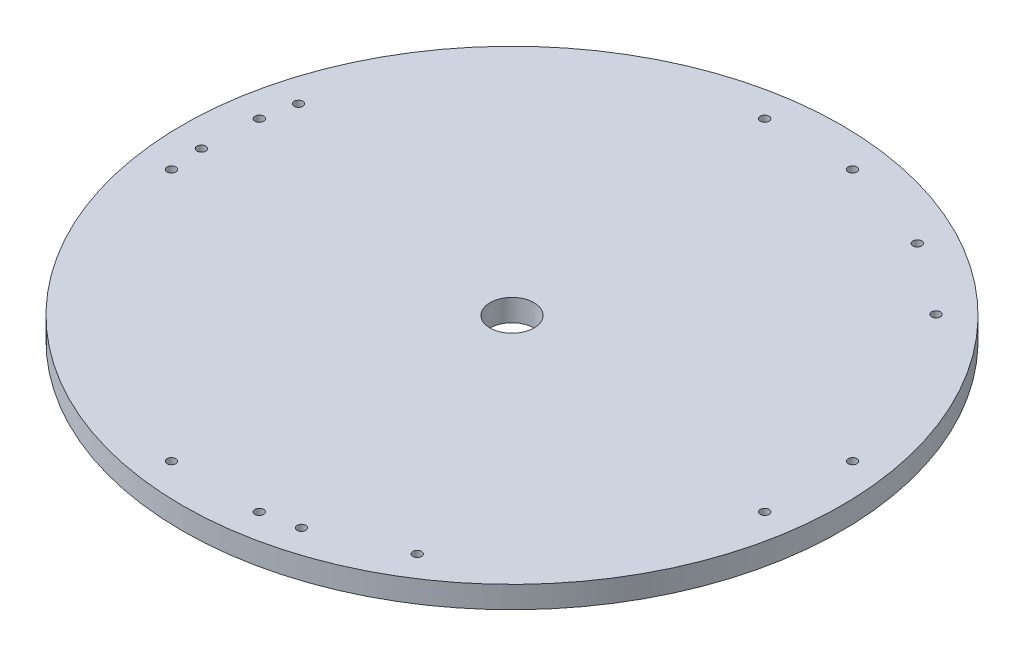
ISO-10303-21;
HEADER;
FILE_DESCRIPTION(('STEP AP214'),'2;1');
FILE_NAME('part.step','',(''),(''),'','','');
FILE_SCHEMA(('AUTOMOTIVE_DESIGN { 1 0 10303 214 1 1 1 1 }'));
ENDSEC;
DATA;
#1=APPLICATION_CONTEXT('core data for automotive mechanical design processes');
#2=APPLICATION_PROTOCOL_DEFINITION('international standard','automotive_design',2000,#1);
#3=PRODUCT_CONTEXT('',#1,'mechanical');
#4=PRODUCT('Part','Part','',(#3));
#5=PRODUCT_RELATED_PRODUCT_CATEGORY('part','',(#4));
#6=PRODUCT_DEFINITION_FORMATION('','',#4);
#7=PRODUCT_DEFINITION_CONTEXT('part definition',#1,'design');
#8=PRODUCT_DEFINITION('design','',#6,#7);
#9=PRODUCT_DEFINITION_SHAPE('','',#8);
#10=(LENGTH_UNIT() NAMED_UNIT(*) SI_UNIT(.MILLI.,.METRE.));
#11=(NAMED_UNIT(*) PLANE_ANGLE_UNIT() SI_UNIT($,.RADIAN.));
#12=(NAMED_UNIT(*) SI_UNIT($,.STERADIAN.) SOLID_ANGLE_UNIT());
#13=UNCERTAINTY_MEASURE_WITH_UNIT(LENGTH_MEASURE(1.E-05),#10,'distance_accuracy_value','');
#14=(GEOMETRIC_REPRESENTATION_CONTEXT(3) GLOBAL_UNCERTAINTY_ASSIGNED_CONTEXT((#13)) GLOBAL_UNIT_ASSIGNED_CONTEXT((#10,
#11,#12)) REPRESENTATION_CONTEXT('',''));
#15=CARTESIAN_POINT('',(0.,0.,0.));
#16=DIRECTION('',(0.,0.,1.));
#17=DIRECTION('',(1.,0.,0.));
#18=AXIS2_PLACEMENT_3D('',#15,#16,#17);
#19=CARTESIAN_POINT('',(-20.,10.,-135.));
#20=DIRECTION('',(0.,-1.,0.));
#21=DIRECTION('',(0.,0.,-1.));
#22=AXIS2_PLACEMENT_3D('',#19,#20,#21);
#23=CYLINDRICAL_SURFACE('',#22,2.00000000000001);
#24=CARTESIAN_POINT('',(-20.,10.,-135.));
#25=DIRECTION('',(0.,1.,0.));
#26=DIRECTION('',(0.,0.,1.));
#27=AXIS2_PLACEMENT_3D('',#24,#25,#26);
#28=CIRCLE('',#27,2.00000000000001);
#29=CARTESIAN_POINT('',(-20.,10.,-133.));
#30=VERTEX_POINT('',#29);
#31=EDGE_CURVE('E48',#30,#30,#28,.T.);
#32=ORIENTED_EDGE('',*,*,#31,.T.);
#33=EDGE_LOOP('',(#32));
#34=FACE_BOUND('',#33,.T.);
#35=CARTESIAN_POINT('',(-20.,0.,-135.));
#36=DIRECTION('',(0.,1.,0.));
#37=DIRECTION('',(0.,0.,1.));
#38=AXIS2_PLACEMENT_3D('',#35,#36,#37);
#39=CIRCLE('',#38,2.00000000000001);
#40=CARTESIAN_POINT('',(-20.,0.,-133.));
#41=VERTEX_POINT('',#40);
#42=EDGE_CURVE('E98',#41,#41,#39,.T.);
#43=ORIENTED_EDGE('',*,*,#42,.F.);
#44=EDGE_LOOP('',(#43));
#45=FACE_BOUND('',#44,.T.);
#46=ADVANCED_FACE('F40',(#34,#45),#23,.F.);
#47=CARTESIAN_POINT('',(20.,10.,-135.));
#48=DIRECTION('',(0.,-1.,0.));
#49=DIRECTION('',(0.,0.,-1.));
#50=AXIS2_PLACEMENT_3D('',#47,#48,#49);
#51=CYLINDRICAL_SURFACE('',#50,2.00000000000001);
#52=CARTESIAN_POINT('',(20.,10.,-135.));
#53=DIRECTION('',(0.,1.,0.));
#54=DIRECTION('',(0.,0.,1.));
#55=AXIS2_PLACEMENT_3D('',#52,#53,#54);
#56=CIRCLE('',#55,2.00000000000001);
#57=CARTESIAN_POINT('',(20.,10.,-133.));
#58=VERTEX_POINT('',#57);
#59=EDGE_CURVE('E53',#58,#58,#56,.T.);
#60=ORIENTED_EDGE('',*,*,#59,.T.);
#61=EDGE_LOOP('',(#60));
#62=FACE_BOUND('',#61,.T.);
#63=CARTESIAN_POINT('',(20.,0.,-135.));
#64=DIRECTION('',(0.,1.,0.));
#65=DIRECTION('',(0.,0.,1.));
#66=AXIS2_PLACEMENT_3D('',#63,#64,#65);
#67=CIRCLE('',#66,2.00000000000001);
#68=CARTESIAN_POINT('',(20.,0.,-133.));
#69=VERTEX_POINT('',#68);
#70=EDGE_CURVE('E96',#69,#69,#67,.T.);
#71=ORIENTED_EDGE('',*,*,#70,.F.);
#72=EDGE_LOOP('',(#71));
#73=FACE_BOUND('',#72,.T.);
#74=ADVANCED_FACE('F149',(#62,#73),#51,.F.);
#75=CARTESIAN_POINT('',(135.000000000007,10.,-20.0000000000088));
#76=DIRECTION('',(0.,-1.,0.));
#77=DIRECTION('',(0.,0.,-1.));
#78=AXIS2_PLACEMENT_3D('',#75,#76,#77);
#79=CYLINDRICAL_SURFACE('',#78,2.000000000007);
#80=CARTESIAN_POINT('',(135.000000000007,10.,-20.0000000000088));
#81=DIRECTION('',(0.,1.,0.));
#82=DIRECTION('',(0.,0.,1.));
#83=AXIS2_PLACEMENT_3D('',#80,#81,#82);
#84=CIRCLE('',#83,2.000000000007);
#85=CARTESIAN_POINT('',(135.000000000007,10.,-18.0000000000018));
#86=VERTEX_POINT('',#85);
#87=EDGE_CURVE('E144',#86,#86,#84,.T.);
#88=ORIENTED_EDGE('',*,*,#87,.T.);
#89=EDGE_LOOP('',(#88));
#90=FACE_BOUND('',#89,.T.);
#91=CARTESIAN_POINT('',(135.000000000007,0.,-20.0000000000088));
#92=DIRECTION('',(0.,1.,0.));
#93=DIRECTION('',(0.,0.,1.));
#94=AXIS2_PLACEMENT_3D('',#91,#92,#93);
#95=CIRCLE('',#94,2.000000000007);
#96=CARTESIAN_POINT('',(135.000000000007,0.,-18.0000000000018));
#97=VERTEX_POINT('',#96);
#98=EDGE_CURVE('E93',#97,#97,#95,.T.);
#99=ORIENTED_EDGE('',*,*,#98,.F.);
#100=EDGE_LOOP('',(#99));
#101=FACE_BOUND('',#100,.T.);
#102=ADVANCED_FACE('F167',(#90,#101),#79,.F.);
#103=CARTESIAN_POINT('',(135.000000000007,10.,19.9999999999912));
#104=DIRECTION('',(0.,-1.,0.));
#105=DIRECTION('',(0.,0.,-1.));
#106=AXIS2_PLACEMENT_3D('',#103,#104,#105);
#107=CYLINDRICAL_SURFACE('',#106,2.00000000000697);
#108=CARTESIAN_POINT('',(135.000000000007,10.,19.9999999999912));
#109=DIRECTION('',(0.,1.,0.));
#110=DIRECTION('',(0.,0.,1.));
#111=AXIS2_PLACEMENT_3D('',#108,#109,#110);
#112=CIRCLE('',#111,2.00000000000697);
#113=CARTESIAN_POINT('',(135.000000000007,10.,21.9999999999981));
#114=VERTEX_POINT('',#113);
#115=EDGE_CURVE('E141',#114,#114,#112,.T.);
#116=ORIENTED_EDGE('',*,*,#115,.T.);
#117=EDGE_LOOP('',(#116));
#118=FACE_BOUND('',#117,.T.);
#119=CARTESIAN_POINT('',(135.000000000007,0.,19.9999999999912));
#120=DIRECTION('',(0.,1.,0.));
#121=DIRECTION('',(0.,0.,1.));
#122=AXIS2_PLACEMENT_3D('',#119,#120,#121);
#123=CIRCLE('',#122,2.00000000000697);
#124=CARTESIAN_POINT('',(135.000000000007,0.,21.9999999999981));
#125=VERTEX_POINT('',#124);
#126=EDGE_CURVE('E90',#125,#125,#123,.T.);
#127=ORIENTED_EDGE('',*,*,#126,.F.);
#128=EDGE_LOOP('',(#127));
#129=FACE_BOUND('',#128,.T.);
#130=ADVANCED_FACE('F174',(#118,#129),#107,.F.);
#131=CARTESIAN_POINT('',(20.0000000000154,10.,134.999999999998));
#132=DIRECTION('',(0.,-1.,0.));
#133=DIRECTION('',(0.,0.,-1.));
#134=AXIS2_PLACEMENT_3D('',#131,#132,#133);
#135=CYLINDRICAL_SURFACE('',#134,2.00000000001634);
#136=CARTESIAN_POINT('',(20.0000000000154,10.,134.999999999998));
#137=DIRECTION('',(0.,1.,0.));
#138=DIRECTION('',(0.,0.,1.));
#139=AXIS2_PLACEMENT_3D('',#136,#137,#138);
#140=CIRCLE('',#139,2.00000000001634);
#141=CARTESIAN_POINT('',(20.0000000000154,10.,137.000000000014));
#142=VERTEX_POINT('',#141);
#143=EDGE_CURVE('E138',#142,#142,#140,.T.);
#144=ORIENTED_EDGE('',*,*,#143,.T.);
#145=EDGE_LOOP('',(#144));
#146=FACE_BOUND('',#145,.T.);
#147=CARTESIAN_POINT('',(20.0000000000154,0.,134.999999999998));
#148=DIRECTION('',(0.,1.,0.));
#149=DIRECTION('',(0.,0.,1.));
#150=AXIS2_PLACEMENT_3D('',#147,#148,#149);
#151=CIRCLE('',#150,2.00000000001634);
#152=CARTESIAN_POINT('',(20.0000000000154,0.,137.000000000014));
#153=VERTEX_POINT('',#152);
#154=EDGE_CURVE('E87',#153,#153,#151,.T.);
#155=ORIENTED_EDGE('',*,*,#154,.F.);
#156=EDGE_LOOP('',(#155));
#157=FACE_BOUND('',#156,.T.);
#158=ADVANCED_FACE('F178',(#146,#157),#135,.F.);
#159=CARTESIAN_POINT('',(-19.9999999999846,10.,134.999999999998));
#160=DIRECTION('',(0.,-1.,0.));
#161=DIRECTION('',(0.,0.,-1.));
#162=AXIS2_PLACEMENT_3D('',#159,#160,#161);
#163=CYLINDRICAL_SURFACE('',#162,2.00000000001625);
#164=CARTESIAN_POINT('',(-19.9999999999846,10.,134.999999999998));
#165=DIRECTION('',(0.,1.,0.));
#166=DIRECTION('',(0.,0.,1.));
#167=AXIS2_PLACEMENT_3D('',#164,#165,#166);
#168=CIRCLE('',#167,2.00000000001625);
#169=CARTESIAN_POINT('',(-19.9999999999846,10.,137.000000000014));
#170=VERTEX_POINT('',#169);
#171=EDGE_CURVE('E135',#170,#170,#168,.T.);
#172=ORIENTED_EDGE('',*,*,#171,.T.);
#173=EDGE_LOOP('',(#172));
#174=FACE_BOUND('',#173,.T.);
#175=CARTESIAN_POINT('',(-19.9999999999846,0.,134.999999999998));
#176=DIRECTION('',(0.,1.,0.));
#177=DIRECTION('',(0.,0.,1.));
#178=AXIS2_PLACEMENT_3D('',#175,#176,#177);
#179=CIRCLE('',#178,2.00000000001625);
#180=CARTESIAN_POINT('',(-19.9999999999846,0.,137.000000000014));
#181=VERTEX_POINT('',#180);
#182=EDGE_CURVE('E84',#181,#181,#179,.T.);
#183=ORIENTED_EDGE('',*,*,#182,.F.);
#184=EDGE_LOOP('',(#183));
#185=FACE_BOUND('',#184,.T.);
#186=ADVANCED_FACE('F182',(#174,#185),#163,.F.);
#187=CARTESIAN_POINT('',(-134.999999999991,10.,20.0000000000066));
#188=DIRECTION('',(0.,-1.,0.));
#189=DIRECTION('',(0.,0.,-1.));
#190=AXIS2_PLACEMENT_3D('',#187,#188,#189);
#191=CYLINDRICAL_SURFACE('',#190,2.00000000001029);
#192=CARTESIAN_POINT('',(-134.999999999991,10.,20.0000000000066));
#193=DIRECTION('',(0.,1.,0.));
#194=DIRECTION('',(0.,0.,1.));
#195=AXIS2_PLACEMENT_3D('',#192,#193,#194);
#196=CIRCLE('',#195,2.00000000001029);
#197=CARTESIAN_POINT('',(-134.999999999991,10.,22.0000000000169));
#198=VERTEX_POINT('',#197);
#199=EDGE_CURVE('E132',#198,#198,#196,.T.);
#200=ORIENTED_EDGE('',*,*,#199,.T.);
#201=EDGE_LOOP('',(#200));
#202=FACE_BOUND('',#201,.T.);
#203=CARTESIAN_POINT('',(-134.999999999991,0.,20.0000000000066));
#204=DIRECTION('',(0.,1.,0.));
#205=DIRECTION('',(0.,0.,1.));
#206=AXIS2_PLACEMENT_3D('',#203,#204,#205);
#207=CIRCLE('',#206,2.00000000001029);
#208=CARTESIAN_POINT('',(-134.999999999991,0.,22.0000000000169));
#209=VERTEX_POINT('',#208);
#210=EDGE_CURVE('E81',#209,#209,#207,.T.);
#211=ORIENTED_EDGE('',*,*,#210,.F.);
#212=EDGE_LOOP('',(#211));
#213=FACE_BOUND('',#212,.T.);
#214=ADVANCED_FACE('F186',(#202,#213),#191,.F.);
#215=CARTESIAN_POINT('',(-134.999999999991,10.,-19.9999999999934));
#216=DIRECTION('',(0.,-1.,0.));
#217=DIRECTION('',(0.,0.,-1.));
#218=AXIS2_PLACEMENT_3D('',#215,#216,#217);
#219=CYLINDRICAL_SURFACE('',#218,2.00000000001017);
#220=CARTESIAN_POINT('',(-134.999999999991,10.,-19.9999999999934));
#221=DIRECTION('',(0.,1.,0.));
#222=DIRECTION('',(0.,0.,1.));
#223=AXIS2_PLACEMENT_3D('',#220,#221,#222);
#224=CIRCLE('',#223,2.00000000001017);
#225=CARTESIAN_POINT('',(-134.999999999991,10.,-17.9999999999833));
#226=VERTEX_POINT('',#225);
#227=EDGE_CURVE('E129',#226,#226,#224,.T.);
#228=ORIENTED_EDGE('',*,*,#227,.T.);
#229=EDGE_LOOP('',(#228));
#230=FACE_BOUND('',#229,.T.);
#231=CARTESIAN_POINT('',(-134.999999999991,0.,-19.9999999999934));
#232=DIRECTION('',(0.,1.,0.));
#233=DIRECTION('',(0.,0.,1.));
#234=AXIS2_PLACEMENT_3D('',#231,#232,#233);
#235=CIRCLE('',#234,2.00000000001017);
#236=CARTESIAN_POINT('',(-134.999999999991,0.,-17.9999999999833));
#237=VERTEX_POINT('',#236);
#238=EDGE_CURVE('E78',#237,#237,#235,.T.);
#239=ORIENTED_EDGE('',*,*,#238,.F.);
#240=EDGE_LOOP('',(#239));
#241=FACE_BOUND('',#240,.T.);
#242=ADVANCED_FACE('F190',(#230,#241),#219,.F.);
#243=CARTESIAN_POINT('',(0.,10.,0.));
#244=DIRECTION('',(0.,-1.,0.));
#245=DIRECTION('',(0.,0.,-1.));
#246=AXIS2_PLACEMENT_3D('',#243,#244,#245);
#247=CYLINDRICAL_SURFACE('',#246,10.);
#248=CARTESIAN_POINT('',(0.,10.,0.));
#249=DIRECTION('',(0.,1.,0.));
#250=DIRECTION('',(0.,0.,1.));
#251=AXIS2_PLACEMENT_3D('',#248,#249,#250);
#252=CIRCLE('',#251,10.);
#253=CARTESIAN_POINT('',(0.,10.,10.));
#254=VERTEX_POINT('',#253);
#255=EDGE_CURVE('E126',#254,#254,#252,.T.);
#256=ORIENTED_EDGE('',*,*,#255,.T.);
#257=EDGE_LOOP('',(#256));
#258=FACE_BOUND('',#257,.T.);
#259=CARTESIAN_POINT('',(0.,0.,0.));
#260=DIRECTION('',(0.,1.,0.));
#261=DIRECTION('',(0.,0.,1.));
#262=AXIS2_PLACEMENT_3D('',#259,#260,#261);
#263=CIRCLE('',#262,10.);
#264=CARTESIAN_POINT('',(0.,0.,10.));
#265=VERTEX_POINT('',#264);
#266=EDGE_CURVE('E75',#265,#265,#263,.T.);
#267=ORIENTED_EDGE('',*,*,#266,.F.);
#268=EDGE_LOOP('',(#267));
#269=FACE_BOUND('',#268,.T.);
#270=ADVANCED_FACE('F194',(#258,#269),#247,.F.);
#271=CARTESIAN_POINT('',(63.8899532067174,10.,-120.59466770651));
#272=DIRECTION('',(0.,-1.,0.));
#273=DIRECTION('',(0.,0.,-1.));
#274=AXIS2_PLACEMENT_3D('',#271,#272,#273);
#275=CYLINDRICAL_SURFACE('',#274,2.);
#276=CARTESIAN_POINT('',(63.8899532067174,10.,-120.59466770651));
#277=DIRECTION('',(0.,1.,0.));
#278=DIRECTION('',(0.,0.,1.));
#279=AXIS2_PLACEMENT_3D('',#276,#277,#278);
#280=CIRCLE('',#279,2.);
#281=CARTESIAN_POINT('',(63.8899532067174,10.,-118.59466770651));
#282=VERTEX_POINT('',#281);
#283=EDGE_CURVE('E123',#282,#282,#280,.T.);
#284=ORIENTED_EDGE('',*,*,#283,.T.);
#285=EDGE_LOOP('',(#284));
#286=FACE_BOUND('',#285,.T.);
#287=CARTESIAN_POINT('',(63.8899532067174,0.,-120.59466770651));
#288=DIRECTION('',(0.,1.,0.));
#289=DIRECTION('',(0.,0.,1.));
#290=AXIS2_PLACEMENT_3D('',#287,#288,#289);
#291=CIRCLE('',#290,2.);
#292=CARTESIAN_POINT('',(63.8899532067174,0.,-118.59466770651));
#293=VERTEX_POINT('',#292);
#294=EDGE_CURVE('E72',#293,#293,#291,.T.);
#295=ORIENTED_EDGE('',*,*,#294,.F.);
#296=EDGE_LOOP('',(#295));
#297=FACE_BOUND('',#296,.T.);
#298=ADVANCED_FACE('F198',(#286,#297),#275,.F.);
#299=CARTESIAN_POINT('',(96.1100467932826,10.,-96.8909640028059));
#300=DIRECTION('',(0.,-1.,0.));
#301=DIRECTION('',(0.,0.,-1.));
#302=AXIS2_PLACEMENT_3D('',#299,#300,#301);
#303=CYLINDRICAL_SURFACE('',#302,2.);
#304=CARTESIAN_POINT('',(96.1100467932826,10.,-96.8909640028059));
#305=DIRECTION('',(0.,1.,0.));
#306=DIRECTION('',(0.,0.,1.));
#307=AXIS2_PLACEMENT_3D('',#304,#305,#306);
#308=CIRCLE('',#307,2.);
#309=CARTESIAN_POINT('',(96.1100467932826,10.,-94.8909640028059));
#310=VERTEX_POINT('',#309);
#311=EDGE_CURVE('E120',#310,#310,#308,.T.);
#312=ORIENTED_EDGE('',*,*,#311,.T.);
#313=EDGE_LOOP('',(#312));
#314=FACE_BOUND('',#313,.T.);
#315=CARTESIAN_POINT('',(96.1100467932826,0.,-96.8909640028059));
#316=DIRECTION('',(0.,1.,0.));
#317=DIRECTION('',(0.,0.,1.));
#318=AXIS2_PLACEMENT_3D('',#315,#316,#317);
#319=CIRCLE('',#318,2.);
#320=CARTESIAN_POINT('',(96.1100467932826,0.,-94.8909640028059));
#321=VERTEX_POINT('',#320);
#322=EDGE_CURVE('E69',#321,#321,#319,.T.);
#323=ORIENTED_EDGE('',*,*,#322,.F.);
#324=EDGE_LOOP('',(#323));
#325=FACE_BOUND('',#324,.T.);
#326=ADVANCED_FACE('F202',(#314,#325),#303,.F.);
#327=CARTESIAN_POINT('',(72.4930691914384,10.,115.627656376871));
#328=DIRECTION('',(0.,-1.,0.));
#329=DIRECTION('',(0.,0.,-1.));
#330=AXIS2_PLACEMENT_3D('',#327,#328,#329);
#331=CYLINDRICAL_SURFACE('',#330,2.00000000000466);
#332=CARTESIAN_POINT('',(72.4930691914384,10.,115.627656376871));
#333=DIRECTION('',(0.,1.,0.));
#334=DIRECTION('',(0.,0.,1.));
#335=AXIS2_PLACEMENT_3D('',#332,#333,#334);
#336=CIRCLE('',#335,2.00000000000466);
#337=CARTESIAN_POINT('',(72.4930691914384,10.,117.627656376875));
#338=VERTEX_POINT('',#337);
#339=EDGE_CURVE('E117',#338,#338,#336,.T.);
#340=ORIENTED_EDGE('',*,*,#339,.T.);
#341=EDGE_LOOP('',(#340));
#342=FACE_BOUND('',#341,.T.);
#343=CARTESIAN_POINT('',(72.4930691914384,0.,115.627656376871));
#344=DIRECTION('',(0.,1.,0.));
#345=DIRECTION('',(0.,0.,1.));
#346=AXIS2_PLACEMENT_3D('',#343,#344,#345);
#347=CIRCLE('',#346,2.00000000000466);
#348=CARTESIAN_POINT('',(72.4930691914384,0.,117.627656376875));
#349=VERTEX_POINT('',#348);
#350=EDGE_CURVE('E66',#349,#349,#347,.T.);
#351=ORIENTED_EDGE('',*,*,#350,.F.);
#352=EDGE_LOOP('',(#351));
#353=FACE_BOUND('',#352,.T.);
#354=ADVANCED_FACE('F206',(#342,#353),#331,.F.);
#355=CARTESIAN_POINT('',(35.8550128269691,10.,131.679224083296));
#356=DIRECTION('',(0.,-1.,0.));
#357=DIRECTION('',(0.,0.,-1.));
#358=AXIS2_PLACEMENT_3D('',#355,#356,#357);
#359=CYLINDRICAL_SURFACE('',#358,2.00000000000453);
#360=CARTESIAN_POINT('',(35.8550128269691,10.,131.679224083296));
#361=DIRECTION('',(0.,1.,0.));
#362=DIRECTION('',(0.,0.,1.));
#363=AXIS2_PLACEMENT_3D('',#360,#361,#362);
#364=CIRCLE('',#363,2.00000000000453);
#365=CARTESIAN_POINT('',(35.8550128269691,10.,133.679224083301));
#366=VERTEX_POINT('',#365);
#367=EDGE_CURVE('E112',#366,#366,#364,.T.);
#368=ORIENTED_EDGE('',*,*,#367,.T.);
#369=EDGE_LOOP('',(#368));
#370=FACE_BOUND('',#369,.T.);
#371=CARTESIAN_POINT('',(35.8550128269691,0.,131.679224083296));
#372=DIRECTION('',(0.,1.,0.));
#373=DIRECTION('',(0.,0.,1.));
#374=AXIS2_PLACEMENT_3D('',#371,#372,#373);
#375=CIRCLE('',#374,2.00000000000453);
#376=CARTESIAN_POINT('',(35.8550128269691,0.,133.679224083301));
#377=VERTEX_POINT('',#376);
#378=EDGE_CURVE('E63',#377,#377,#375,.T.);
#379=ORIENTED_EDGE('',*,*,#378,.F.);
#380=EDGE_LOOP('',(#379));
#381=FACE_BOUND('',#380,.T.);
#382=ADVANCED_FACE('F210',(#370,#381),#359,.F.);
#383=CARTESIAN_POINT('',(-136.38302239813,10.,4.96701132965298));
#384=DIRECTION('',(0.,-1.,0.));
#385=DIRECTION('',(0.,0.,-1.));
#386=AXIS2_PLACEMENT_3D('',#383,#384,#385);
#387=CYLINDRICAL_SURFACE('',#386,2.00000000001718);
#388=CARTESIAN_POINT('',(-136.38302239813,10.,4.96701132965298));
#389=DIRECTION('',(0.,1.,0.));
#390=DIRECTION('',(0.,0.,1.));
#391=AXIS2_PLACEMENT_3D('',#388,#389,#390);
#392=CIRCLE('',#391,2.00000000001718);
#393=CARTESIAN_POINT('',(-136.38302239813,10.,6.96701132967017));
#394=VERTEX_POINT('',#393);
#395=EDGE_CURVE('E107',#394,#394,#392,.T.);
#396=ORIENTED_EDGE('',*,*,#395,.T.);
#397=EDGE_LOOP('',(#396));
#398=FACE_BOUND('',#397,.T.);
#399=CARTESIAN_POINT('',(-136.38302239813,0.,4.96701132965298));
#400=DIRECTION('',(0.,1.,0.));
#401=DIRECTION('',(0.,0.,1.));
#402=AXIS2_PLACEMENT_3D('',#399,#400,#401);
#403=CIRCLE('',#402,2.00000000001718);
#404=CARTESIAN_POINT('',(-136.38302239813,0.,6.96701132967017));
#405=VERTEX_POINT('',#404);
#406=EDGE_CURVE('E60',#405,#405,#403,.T.);
#407=ORIENTED_EDGE('',*,*,#406,.F.);
#408=EDGE_LOOP('',(#407));
#409=FACE_BOUND('',#408,.T.);
#410=ADVANCED_FACE('F213',(#398,#409),#387,.F.);
#411=CARTESIAN_POINT('',(-131.965059620226,10.,-34.7882600804765));
#412=DIRECTION('',(0.,-1.,0.));
#413=DIRECTION('',(0.,0.,-1.));
#414=AXIS2_PLACEMENT_3D('',#411,#412,#413);
#415=CYLINDRICAL_SURFACE('',#414,2.00000000001687);
#416=CARTESIAN_POINT('',(-131.965059620226,10.,-34.7882600804765));
#417=DIRECTION('',(0.,1.,0.));
#418=DIRECTION('',(0.,0.,1.));
#419=AXIS2_PLACEMENT_3D('',#416,#417,#418);
#420=CIRCLE('',#419,2.00000000001687);
#421=CARTESIAN_POINT('',(-131.965059620226,10.,-32.7882600804596));
#422=VERTEX_POINT('',#421);
#423=EDGE_CURVE('E103',#422,#422,#420,.T.);
#424=ORIENTED_EDGE('',*,*,#423,.T.);
#425=EDGE_LOOP('',(#424));
#426=FACE_BOUND('',#425,.T.);
#427=CARTESIAN_POINT('',(-131.965059620226,0.,-34.7882600804765));
#428=DIRECTION('',(0.,1.,0.));
#429=DIRECTION('',(0.,0.,1.));
#430=AXIS2_PLACEMENT_3D('',#427,#428,#429);
#431=CIRCLE('',#430,2.00000000001687);
#432=CARTESIAN_POINT('',(-131.965059620226,0.,-32.7882600804596));
#433=VERTEX_POINT('',#432);
#434=EDGE_CURVE('E57',#433,#433,#431,.T.);
#435=ORIENTED_EDGE('',*,*,#434,.F.);
#436=EDGE_LOOP('',(#435));
#437=FACE_BOUND('',#436,.T.);
#438=ADVANCED_FACE('F42',(#426,#437),#415,.F.);
#439=CARTESIAN_POINT('',(0.,10.,0.));
#440=DIRECTION('',(0.,-1.,0.));
#441=DIRECTION('',(0.,0.,-1.));
#442=AXIS2_PLACEMENT_3D('',#439,#440,#441);
#443=CYLINDRICAL_SURFACE('',#442,150.);
#444=CARTESIAN_POINT('',(0.,10.,0.));
#445=DIRECTION('',(0.,1.,0.));
#446=DIRECTION('',(0.,0.,1.));
#447=AXIS2_PLACEMENT_3D('',#444,#445,#446);
#448=CIRCLE('',#447,150.);
#449=CARTESIAN_POINT('',(0.,10.,150.));
#450=VERTEX_POINT('',#449);
#451=EDGE_CURVE('E10',#450,#450,#448,.T.);
#452=ORIENTED_EDGE('',*,*,#451,.F.);
#453=EDGE_LOOP('',(#452));
#454=FACE_BOUND('',#453,.T.);
#455=CARTESIAN_POINT('',(0.,0.,0.));
#456=DIRECTION('',(0.,1.,0.));
#457=DIRECTION('',(0.,0.,1.));
#458=AXIS2_PLACEMENT_3D('',#455,#456,#457);
#459=CIRCLE('',#458,150.);
#460=CARTESIAN_POINT('',(0.,0.,150.));
#461=VERTEX_POINT('',#460);
#462=EDGE_CURVE('E44',#461,#461,#459,.T.);
#463=ORIENTED_EDGE('',*,*,#462,.T.);
#464=EDGE_LOOP('',(#463));
#465=FACE_BOUND('',#464,.T.);
#466=ADVANCED_FACE('F156',(#454,#465),#443,.T.);
#467=CARTESIAN_POINT('',(0.,10.,0.));
#468=DIRECTION('',(0.,1.,0.));
#469=DIRECTION('',(0.,0.,1.));
#470=AXIS2_PLACEMENT_3D('',#467,#468,#469);
#471=PLANE('',#470);
#472=ORIENTED_EDGE('',*,*,#423,.F.);
#473=EDGE_LOOP('',(#472));
#474=FACE_BOUND('',#473,.T.);
#475=ORIENTED_EDGE('',*,*,#395,.F.);
#476=EDGE_LOOP('',(#475));
#477=FACE_BOUND('',#476,.T.);
#478=ORIENTED_EDGE('',*,*,#367,.F.);
#479=EDGE_LOOP('',(#478));
#480=FACE_BOUND('',#479,.T.);
#481=ORIENTED_EDGE('',*,*,#339,.F.);
#482=EDGE_LOOP('',(#481));
#483=FACE_BOUND('',#482,.T.);
#484=ORIENTED_EDGE('',*,*,#311,.F.);
#485=EDGE_LOOP('',(#484));
#486=FACE_BOUND('',#485,.T.);
#487=ORIENTED_EDGE('',*,*,#283,.F.);
#488=EDGE_LOOP('',(#487));
#489=FACE_BOUND('',#488,.T.);
#490=ORIENTED_EDGE('',*,*,#255,.F.);
#491=EDGE_LOOP('',(#490));
#492=FACE_BOUND('',#491,.T.);
#493=ORIENTED_EDGE('',*,*,#227,.F.);
#494=EDGE_LOOP('',(#493));
#495=FACE_BOUND('',#494,.T.);
#496=ORIENTED_EDGE('',*,*,#199,.F.);
#497=EDGE_LOOP('',(#496));
#498=FACE_BOUND('',#497,.T.);
#499=ORIENTED_EDGE('',*,*,#171,.F.);
#500=EDGE_LOOP('',(#499));
#501=FACE_BOUND('',#500,.T.);
#502=ORIENTED_EDGE('',*,*,#143,.F.);
#503=EDGE_LOOP('',(#502));
#504=FACE_BOUND('',#503,.T.);
#505=ORIENTED_EDGE('',*,*,#115,.F.);
#506=EDGE_LOOP('',(#505));
#507=FACE_BOUND('',#506,.T.);
#508=ORIENTED_EDGE('',*,*,#87,.F.);
#509=EDGE_LOOP('',(#508));
#510=FACE_BOUND('',#509,.T.);
#511=ORIENTED_EDGE('',*,*,#59,.F.);
#512=EDGE_LOOP('',(#511));
#513=FACE_BOUND('',#512,.T.);
#514=ORIENTED_EDGE('',*,*,#31,.F.);
#515=EDGE_LOOP('',(#514));
#516=FACE_BOUND('',#515,.T.);
#517=ORIENTED_EDGE('',*,*,#451,.T.);
#518=EDGE_LOOP('',(#517));
#519=FACE_BOUND('',#518,.T.);
#520=ADVANCED_FACE('F152',(#474,#477,#480,#483,#486,#489,#492,#495,#498,#501,#504,#507,#510,
#513,#516,#519),#471,.T.);
#521=CARTESIAN_POINT('',(0.,0.,0.));
#522=DIRECTION('',(0.,1.,0.));
#523=DIRECTION('',(0.,0.,1.));
#524=AXIS2_PLACEMENT_3D('',#521,#522,#523);
#525=PLANE('',#524);
#526=ORIENTED_EDGE('',*,*,#434,.T.);
#527=EDGE_LOOP('',(#526));
#528=FACE_BOUND('',#527,.T.);
#529=ORIENTED_EDGE('',*,*,#406,.T.);
#530=EDGE_LOOP('',(#529));
#531=FACE_BOUND('',#530,.T.);
#532=ORIENTED_EDGE('',*,*,#378,.T.);
#533=EDGE_LOOP('',(#532));
#534=FACE_BOUND('',#533,.T.);
#535=ORIENTED_EDGE('',*,*,#350,.T.);
#536=EDGE_LOOP('',(#535));
#537=FACE_BOUND('',#536,.T.);
#538=ORIENTED_EDGE('',*,*,#322,.T.);
#539=EDGE_LOOP('',(#538));
#540=FACE_BOUND('',#539,.T.);
#541=ORIENTED_EDGE('',*,*,#294,.T.);
#542=EDGE_LOOP('',(#541));
#543=FACE_BOUND('',#542,.T.);
#544=ORIENTED_EDGE('',*,*,#266,.T.);
#545=EDGE_LOOP('',(#544));
#546=FACE_BOUND('',#545,.T.);
#547=ORIENTED_EDGE('',*,*,#238,.T.);
#548=EDGE_LOOP('',(#547));
#549=FACE_BOUND('',#548,.T.);
#550=ORIENTED_EDGE('',*,*,#210,.T.);
#551=EDGE_LOOP('',(#550));
#552=FACE_BOUND('',#551,.T.);
#553=ORIENTED_EDGE('',*,*,#182,.T.);
#554=EDGE_LOOP('',(#553));
#555=FACE_BOUND('',#554,.T.);
#556=ORIENTED_EDGE('',*,*,#154,.T.);
#557=EDGE_LOOP('',(#556));
#558=FACE_BOUND('',#557,.T.);
#559=ORIENTED_EDGE('',*,*,#126,.T.);
#560=EDGE_LOOP('',(#559));
#561=FACE_BOUND('',#560,.T.);
#562=ORIENTED_EDGE('',*,*,#98,.T.);
#563=EDGE_LOOP('',(#562));
#564=FACE_BOUND('',#563,.T.);
#565=ORIENTED_EDGE('',*,*,#70,.T.);
#566=EDGE_LOOP('',(#565));
#567=FACE_BOUND('',#566,.T.);
#568=ORIENTED_EDGE('',*,*,#42,.T.);
#569=EDGE_LOOP('',(#568));
#570=FACE_BOUND('',#569,.T.);
#571=ORIENTED_EDGE('',*,*,#462,.F.);
#572=EDGE_LOOP('',(#571));
#573=FACE_BOUND('',#572,.T.);
#574=ADVANCED_FACE('F155',(#528,#531,#534,#537,#540,#543,#546,#549,#552,#555,#558,#561,#564,
#567,#570,#573),#525,.F.);
#575=CLOSED_SHELL('',(#46,#74,#102,#130,#158,#186,#214,#242,#270,#298,#326,#354,#382,#410,#438,
#466,#520,#574));
#576=MANIFOLD_SOLID_BREP('B2',#575);
#577=ADVANCED_BREP_SHAPE_REPRESENTATION('',(#18,#576),#14);
#578=SHAPE_DEFINITION_REPRESENTATION(#9,#577);
ENDSEC;
END-ISO-10303-21;
